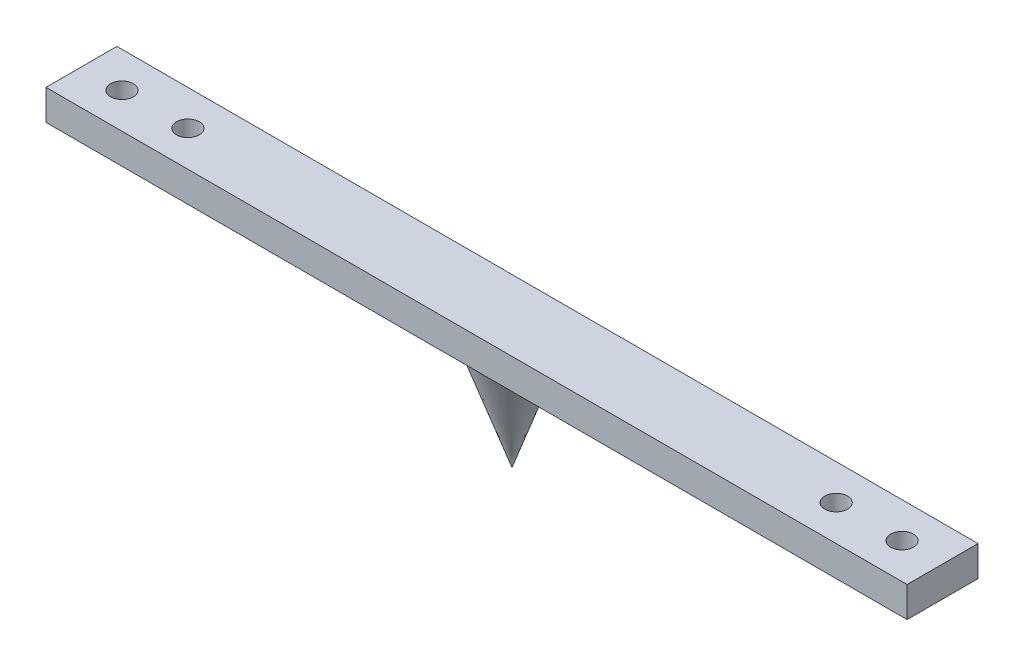
ISO-10303-21;
HEADER;
FILE_DESCRIPTION(('STEP AP214'),'2;1');
FILE_NAME('part.step','',(''),(''),'','','');
FILE_SCHEMA(('AUTOMOTIVE_DESIGN { 1 0 10303 214 1 1 1 1 }'));
ENDSEC;
DATA;
#1=APPLICATION_CONTEXT('core data for automotive mechanical design processes');
#2=APPLICATION_PROTOCOL_DEFINITION('international standard','automotive_design',2000,#1);
#3=PRODUCT_CONTEXT('',#1,'mechanical');
#4=PRODUCT('Part','Part','',(#3));
#5=PRODUCT_RELATED_PRODUCT_CATEGORY('part','',(#4));
#6=PRODUCT_DEFINITION_FORMATION('','',#4);
#7=PRODUCT_DEFINITION_CONTEXT('part definition',#1,'design');
#8=PRODUCT_DEFINITION('design','',#6,#7);
#9=PRODUCT_DEFINITION_SHAPE('','',#8);
#10=(LENGTH_UNIT() NAMED_UNIT(*) SI_UNIT(.MILLI.,.METRE.));
#11=(NAMED_UNIT(*) PLANE_ANGLE_UNIT() SI_UNIT($,.RADIAN.));
#12=(NAMED_UNIT(*) SI_UNIT($,.STERADIAN.) SOLID_ANGLE_UNIT());
#13=UNCERTAINTY_MEASURE_WITH_UNIT(LENGTH_MEASURE(1.E-05),#10,'distance_accuracy_value','');
#14=(GEOMETRIC_REPRESENTATION_CONTEXT(3) GLOBAL_UNCERTAINTY_ASSIGNED_CONTEXT((#13)) GLOBAL_UNIT_ASSIGNED_CONTEXT((#10,
#11,#12)) REPRESENTATION_CONTEXT('',''));
#15=CARTESIAN_POINT('',(0.,0.,0.));
#16=DIRECTION('',(0.,0.,1.));
#17=DIRECTION('',(1.,0.,0.));
#18=AXIS2_PLACEMENT_3D('',#15,#16,#17);
#19=CARTESIAN_POINT('',(0.,0.,0.));
#20=DIRECTION('',(0.,1.,0.));
#21=DIRECTION('',(0.,0.,1.));
#22=AXIS2_PLACEMENT_3D('',#19,#20,#21);
#23=PLANE('',#22);
#24=CARTESIAN_POINT('',(77.,0.,0.));
#25=DIRECTION('',(0.,-1.,0.));
#26=DIRECTION('',(0.,0.,-1.));
#27=AXIS2_PLACEMENT_3D('',#24,#25,#26);
#28=CIRCLE('',#27,3.99999999999999);
#29=CARTESIAN_POINT('',(77.,0.,-3.99999999999999));
#30=VERTEX_POINT('',#29);
#31=EDGE_CURVE('E191',#30,#30,#28,.T.);
#32=ORIENTED_EDGE('',*,*,#31,.F.);
#33=EDGE_LOOP('',(#32));
#34=FACE_BOUND('',#33,.T.);
#35=CARTESIAN_POINT('',(64.,0.,0.));
#36=DIRECTION('',(0.,-1.,0.));
#37=DIRECTION('',(0.,0.,-1.));
#38=AXIS2_PLACEMENT_3D('',#35,#36,#37);
#39=CIRCLE('',#38,3.99999999999999);
#40=CARTESIAN_POINT('',(64.,0.,-3.99999999999999));
#41=VERTEX_POINT('',#40);
#42=EDGE_CURVE('E207',#41,#41,#39,.T.);
#43=ORIENTED_EDGE('',*,*,#42,.F.);
#44=EDGE_LOOP('',(#43));
#45=FACE_BOUND('',#44,.T.);
#46=DIRECTION('',(1.,0.,0.));
#47=VECTOR('',#46,1.);
#48=CARTESIAN_POINT('',(-85.,0.,7.));
#49=LINE('',#48,#47);
#50=CARTESIAN_POINT('',(0.,0.,7.));
#51=VERTEX_POINT('',#50);
#52=CARTESIAN_POINT('',(85.,0.,7.));
#53=VERTEX_POINT('',#52);
#54=EDGE_CURVE('E137',#51,#53,#49,.T.);
#55=ORIENTED_EDGE('',*,*,#54,.F.);
#56=CARTESIAN_POINT('',(0.,0.,0.));
#57=DIRECTION('',(0.,1.,0.));
#58=DIRECTION('',(0.,0.,1.));
#59=AXIS2_PLACEMENT_3D('',#56,#57,#58);
#60=CIRCLE('',#59,7.);
#61=CARTESIAN_POINT('',(0.,0.,-7.));
#62=VERTEX_POINT('',#61);
#63=EDGE_CURVE('E54',#51,#62,#60,.T.);
#64=ORIENTED_EDGE('',*,*,#63,.T.);
#65=DIRECTION('',(-1.,0.,0.));
#66=VECTOR('',#65,1.);
#67=CARTESIAN_POINT('',(-85.,0.,-7.));
#68=LINE('',#67,#66);
#69=CARTESIAN_POINT('',(85.,0.,-7.));
#70=VERTEX_POINT('',#69);
#71=EDGE_CURVE('E153',#70,#62,#68,.T.);
#72=ORIENTED_EDGE('',*,*,#71,.F.);
#73=DIRECTION('',(0.,0.,-1.));
#74=VECTOR('',#73,1.);
#75=CARTESIAN_POINT('',(85.,0.,-7.));
#76=LINE('',#75,#74);
#77=EDGE_CURVE('E144',#53,#70,#76,.T.);
#78=ORIENTED_EDGE('',*,*,#77,.F.);
#79=EDGE_LOOP('',(#55,#64,#72,#78));
#80=FACE_BOUND('',#79,.T.);
#81=ADVANCED_FACE('F39',(#34,#45,#80),#23,.F.);
#82=CARTESIAN_POINT('',(-64.,0.,0.));
#83=DIRECTION('',(0.,-1.,0.));
#84=DIRECTION('',(0.,0.,-1.));
#85=AXIS2_PLACEMENT_3D('',#82,#83,#84);
#86=CIRCLE('',#85,3.99999999999999);
#87=CARTESIAN_POINT('',(-64.,0.,-3.99999999999999));
#88=VERTEX_POINT('',#87);
#89=EDGE_CURVE('E223',#88,#88,#86,.T.);
#90=ORIENTED_EDGE('',*,*,#89,.F.);
#91=EDGE_LOOP('',(#90));
#92=FACE_BOUND('',#91,.T.);
#93=CARTESIAN_POINT('',(-85.,0.,-7.));
#94=VERTEX_POINT('',#93);
#95=EDGE_CURVE('E84',#62,#94,#68,.T.);
#96=ORIENTED_EDGE('',*,*,#95,.F.);
#97=EDGE_CURVE('E244',#62,#51,#60,.T.);
#98=ORIENTED_EDGE('',*,*,#97,.T.);
#99=CARTESIAN_POINT('',(-85.,0.,7.));
#100=VERTEX_POINT('',#99);
#101=EDGE_CURVE('E135',#100,#51,#49,.T.);
#102=ORIENTED_EDGE('',*,*,#101,.F.);
#103=DIRECTION('',(0.,0.,1.));
#104=VECTOR('',#103,1.);
#105=CARTESIAN_POINT('',(-85.,0.,-7.));
#106=LINE('',#105,#104);
#107=EDGE_CURVE('E149',#94,#100,#106,.T.);
#108=ORIENTED_EDGE('',*,*,#107,.F.);
#109=EDGE_LOOP('',(#96,#98,#102,#108));
#110=FACE_BOUND('',#109,.T.);
#111=CARTESIAN_POINT('',(-77.,0.,0.));
#112=DIRECTION('',(0.,-1.,0.));
#113=DIRECTION('',(0.,0.,-1.));
#114=AXIS2_PLACEMENT_3D('',#111,#112,#113);
#115=CIRCLE('',#114,3.99999999999999);
#116=CARTESIAN_POINT('',(-77.,0.,-3.99999999999999));
#117=VERTEX_POINT('',#116);
#118=EDGE_CURVE('E239',#117,#117,#115,.T.);
#119=ORIENTED_EDGE('',*,*,#118,.F.);
#120=EDGE_LOOP('',(#119));
#121=FACE_BOUND('',#120,.T.);
#122=ADVANCED_FACE('F108',(#92,#110,#121),#23,.F.);
#123=CARTESIAN_POINT('',(0.,6.,0.));
#124=DIRECTION('',(0.,1.,0.));
#125=DIRECTION('',(0.,0.,1.));
#126=AXIS2_PLACEMENT_3D('',#123,#124,#125);
#127=PLANE('',#126);
#128=CARTESIAN_POINT('',(-77.,6.,0.));
#129=DIRECTION('',(0.,-1.,0.));
#130=DIRECTION('',(0.,0.,-1.));
#131=AXIS2_PLACEMENT_3D('',#128,#129,#130);
#132=CIRCLE('',#131,2.25);
#133=CARTESIAN_POINT('',(-77.,6.,-2.25));
#134=VERTEX_POINT('',#133);
#135=EDGE_CURVE('E227',#134,#134,#132,.T.);
#136=ORIENTED_EDGE('',*,*,#135,.T.);
#137=EDGE_LOOP('',(#136));
#138=FACE_BOUND('',#137,.T.);
#139=CARTESIAN_POINT('',(-64.,6.,0.));
#140=DIRECTION('',(0.,-1.,0.));
#141=DIRECTION('',(0.,0.,-1.));
#142=AXIS2_PLACEMENT_3D('',#139,#140,#141);
#143=CIRCLE('',#142,2.25);
#144=CARTESIAN_POINT('',(-64.,6.,-2.25));
#145=VERTEX_POINT('',#144);
#146=EDGE_CURVE('E211',#145,#145,#143,.T.);
#147=ORIENTED_EDGE('',*,*,#146,.T.);
#148=EDGE_LOOP('',(#147));
#149=FACE_BOUND('',#148,.T.);
#150=DIRECTION('',(0.,0.,1.));
#151=VECTOR('',#150,1.);
#152=CARTESIAN_POINT('',(-85.,6.,-7.));
#153=LINE('',#152,#151);
#154=CARTESIAN_POINT('',(-85.,6.,-7.));
#155=VERTEX_POINT('',#154);
#156=CARTESIAN_POINT('',(-85.,6.,7.));
#157=VERTEX_POINT('',#156);
#158=EDGE_CURVE('E156',#155,#157,#153,.T.);
#159=ORIENTED_EDGE('',*,*,#158,.T.);
#160=DIRECTION('',(1.,0.,0.));
#161=VECTOR('',#160,1.);
#162=CARTESIAN_POINT('',(-85.,6.,7.));
#163=LINE('',#162,#161);
#164=CARTESIAN_POINT('',(85.,6.,7.));
#165=VERTEX_POINT('',#164);
#166=EDGE_CURVE('E91',#157,#165,#163,.T.);
#167=ORIENTED_EDGE('',*,*,#166,.T.);
#168=DIRECTION('',(0.,0.,-1.));
#169=VECTOR('',#168,1.);
#170=CARTESIAN_POINT('',(85.,6.,-7.));
#171=LINE('',#170,#169);
#172=CARTESIAN_POINT('',(85.,6.,-7.));
#173=VERTEX_POINT('',#172);
#174=EDGE_CURVE('E167',#165,#173,#171,.T.);
#175=ORIENTED_EDGE('',*,*,#174,.T.);
#176=DIRECTION('',(-1.,0.,0.));
#177=VECTOR('',#176,1.);
#178=CARTESIAN_POINT('',(-85.,6.,-7.));
#179=LINE('',#178,#177);
#180=EDGE_CURVE('E63',#173,#155,#179,.T.);
#181=ORIENTED_EDGE('',*,*,#180,.T.);
#182=EDGE_LOOP('',(#159,#167,#175,#181));
#183=FACE_BOUND('',#182,.T.);
#184=CARTESIAN_POINT('',(77.,6.,0.));
#185=DIRECTION('',(0.,-1.,0.));
#186=DIRECTION('',(0.,0.,-1.));
#187=AXIS2_PLACEMENT_3D('',#184,#185,#186);
#188=CIRCLE('',#187,2.25);
#189=CARTESIAN_POINT('',(77.,6.,-2.25));
#190=VERTEX_POINT('',#189);
#191=EDGE_CURVE('E179',#190,#190,#188,.T.);
#192=ORIENTED_EDGE('',*,*,#191,.T.);
#193=EDGE_LOOP('',(#192));
#194=FACE_BOUND('',#193,.T.);
#195=CARTESIAN_POINT('',(64.,6.,0.));
#196=DIRECTION('',(0.,-1.,0.));
#197=DIRECTION('',(0.,0.,-1.));
#198=AXIS2_PLACEMENT_3D('',#195,#196,#197);
#199=CIRCLE('',#198,2.25);
#200=CARTESIAN_POINT('',(64.,6.,-2.25));
#201=VERTEX_POINT('',#200);
#202=EDGE_CURVE('E195',#201,#201,#199,.T.);
#203=ORIENTED_EDGE('',*,*,#202,.T.);
#204=EDGE_LOOP('',(#203));
#205=FACE_BOUND('',#204,.T.);
#206=ADVANCED_FACE('F114',(#138,#149,#183,#194,#205),#127,.T.);
#207=CARTESIAN_POINT('',(-85.,6.,-7.));
#208=DIRECTION('',(1.,0.,0.));
#209=DIRECTION('',(0.,0.,-1.));
#210=AXIS2_PLACEMENT_3D('',#207,#208,#209);
#211=PLANE('',#210);
#212=ORIENTED_EDGE('',*,*,#107,.T.);
#213=DIRECTION('',(0.,-1.,0.));
#214=VECTOR('',#213,1.);
#215=CARTESIAN_POINT('',(-85.,6.,7.));
#216=LINE('',#215,#214);
#217=EDGE_CURVE('E11',#157,#100,#216,.T.);
#218=ORIENTED_EDGE('',*,*,#217,.F.);
#219=ORIENTED_EDGE('',*,*,#158,.F.);
#220=DIRECTION('',(0.,-1.,0.));
#221=VECTOR('',#220,1.);
#222=CARTESIAN_POINT('',(-85.,6.,-7.));
#223=LINE('',#222,#221);
#224=EDGE_CURVE('E157',#155,#94,#223,.T.);
#225=ORIENTED_EDGE('',*,*,#224,.T.);
#226=EDGE_LOOP('',(#212,#218,#219,#225));
#227=FACE_BOUND('',#226,.T.);
#228=ADVANCED_FACE('F41',(#227),#211,.F.);
#229=CARTESIAN_POINT('',(-85.,6.,7.));
#230=DIRECTION('',(0.,0.,-1.));
#231=DIRECTION('',(-1.,0.,0.));
#232=AXIS2_PLACEMENT_3D('',#229,#230,#231);
#233=PLANE('',#232);
#234=ORIENTED_EDGE('',*,*,#101,.T.);
#235=ORIENTED_EDGE('',*,*,#54,.T.);
#236=DIRECTION('',(0.,-1.,0.));
#237=VECTOR('',#236,1.);
#238=CARTESIAN_POINT('',(85.,6.,7.));
#239=LINE('',#238,#237);
#240=EDGE_CURVE('E48',#165,#53,#239,.T.);
#241=ORIENTED_EDGE('',*,*,#240,.F.);
#242=ORIENTED_EDGE('',*,*,#166,.F.);
#243=ORIENTED_EDGE('',*,*,#217,.T.);
#244=EDGE_LOOP('',(#234,#235,#241,#242,#243));
#245=FACE_BOUND('',#244,.T.);
#246=ADVANCED_FACE('F127',(#245),#233,.F.);
#247=CARTESIAN_POINT('',(85.,6.,-7.));
#248=DIRECTION('',(-1.,0.,0.));
#249=DIRECTION('',(0.,0.,1.));
#250=AXIS2_PLACEMENT_3D('',#247,#248,#249);
#251=PLANE('',#250);
#252=ORIENTED_EDGE('',*,*,#77,.T.);
#253=DIRECTION('',(0.,-1.,0.));
#254=VECTOR('',#253,1.);
#255=CARTESIAN_POINT('',(85.,6.,-7.));
#256=LINE('',#255,#254);
#257=EDGE_CURVE('E160',#173,#70,#256,.T.);
#258=ORIENTED_EDGE('',*,*,#257,.F.);
#259=ORIENTED_EDGE('',*,*,#174,.F.);
#260=ORIENTED_EDGE('',*,*,#240,.T.);
#261=EDGE_LOOP('',(#252,#258,#259,#260));
#262=FACE_BOUND('',#261,.T.);
#263=ADVANCED_FACE('F125',(#262),#251,.F.);
#264=CARTESIAN_POINT('',(-85.,6.,-7.));
#265=DIRECTION('',(0.,0.,1.));
#266=DIRECTION('',(1.,0.,0.));
#267=AXIS2_PLACEMENT_3D('',#264,#265,#266);
#268=PLANE('',#267);
#269=ORIENTED_EDGE('',*,*,#71,.T.);
#270=ORIENTED_EDGE('',*,*,#95,.T.);
#271=ORIENTED_EDGE('',*,*,#224,.F.);
#272=ORIENTED_EDGE('',*,*,#180,.F.);
#273=ORIENTED_EDGE('',*,*,#257,.T.);
#274=EDGE_LOOP('',(#269,#270,#271,#272,#273));
#275=FACE_BOUND('',#274,.T.);
#276=ADVANCED_FACE('F121',(#275),#268,.F.);
#277=CARTESIAN_POINT('',(77.,0.,0.));
#278=DIRECTION('',(0.,-1.,0.));
#279=DIRECTION('',(0.,0.,-1.));
#280=AXIS2_PLACEMENT_3D('',#277,#278,#279);
#281=CYLINDRICAL_SURFACE('',#280,2.25000000000001);
#282=ORIENTED_EDGE('',*,*,#191,.F.);
#283=EDGE_LOOP('',(#282));
#284=FACE_BOUND('',#283,.T.);
#285=CARTESIAN_POINT('',(77.,2.2,0.));
#286=DIRECTION('',(0.,-1.,0.));
#287=DIRECTION('',(0.,0.,-1.));
#288=AXIS2_PLACEMENT_3D('',#285,#286,#287);
#289=CIRCLE('',#288,2.25000000000002);
#290=CARTESIAN_POINT('',(77.,2.2,-2.25000000000001));
#291=VERTEX_POINT('',#290);
#292=EDGE_CURVE('E183',#291,#291,#289,.T.);
#293=ORIENTED_EDGE('',*,*,#292,.T.);
#294=EDGE_LOOP('',(#293));
#295=FACE_BOUND('',#294,.T.);
#296=ADVANCED_FACE('F124',(#284,#295),#281,.F.);
#297=CARTESIAN_POINT('',(79.25,2.2,0.));
#298=DIRECTION('',(0.,1.,0.));
#299=DIRECTION('',(0.,0.,1.));
#300=AXIS2_PLACEMENT_3D('',#297,#298,#299);
#301=PLANE('',#300);
#302=ORIENTED_EDGE('',*,*,#292,.F.);
#303=EDGE_LOOP('',(#302));
#304=FACE_BOUND('',#303,.T.);
#305=CARTESIAN_POINT('',(77.,2.2,0.));
#306=DIRECTION('',(0.,-1.,0.));
#307=DIRECTION('',(0.,0.,-1.));
#308=AXIS2_PLACEMENT_3D('',#305,#306,#307);
#309=CIRCLE('',#308,3.99999999999999);
#310=CARTESIAN_POINT('',(77.,2.2,-3.99999999999999));
#311=VERTEX_POINT('',#310);
#312=EDGE_CURVE('E187',#311,#311,#309,.T.);
#313=ORIENTED_EDGE('',*,*,#312,.T.);
#314=EDGE_LOOP('',(#313));
#315=FACE_BOUND('',#314,.T.);
#316=ADVANCED_FACE('F285',(#304,#315),#301,.F.);
#317=CARTESIAN_POINT('',(77.,0.,0.));
#318=DIRECTION('',(0.,-1.,0.));
#319=DIRECTION('',(0.,0.,-1.));
#320=AXIS2_PLACEMENT_3D('',#317,#318,#319);
#321=CYLINDRICAL_SURFACE('',#320,3.99999999999999);
#322=ORIENTED_EDGE('',*,*,#312,.F.);
#323=EDGE_LOOP('',(#322));
#324=FACE_BOUND('',#323,.T.);
#325=ORIENTED_EDGE('',*,*,#31,.T.);
#326=EDGE_LOOP('',(#325));
#327=FACE_BOUND('',#326,.T.);
#328=ADVANCED_FACE('F260',(#324,#327),#321,.F.);
#329=CARTESIAN_POINT('',(64.,0.,0.));
#330=DIRECTION('',(0.,-1.,0.));
#331=DIRECTION('',(0.,0.,-1.));
#332=AXIS2_PLACEMENT_3D('',#329,#330,#331);
#333=CYLINDRICAL_SURFACE('',#332,2.25000000000001);
#334=ORIENTED_EDGE('',*,*,#202,.F.);
#335=EDGE_LOOP('',(#334));
#336=FACE_BOUND('',#335,.T.);
#337=CARTESIAN_POINT('',(64.,2.2,0.));
#338=DIRECTION('',(0.,-1.,0.));
#339=DIRECTION('',(0.,0.,-1.));
#340=AXIS2_PLACEMENT_3D('',#337,#338,#339);
#341=CIRCLE('',#340,2.25000000000002);
#342=CARTESIAN_POINT('',(64.,2.2,-2.25000000000001));
#343=VERTEX_POINT('',#342);
#344=EDGE_CURVE('E199',#343,#343,#341,.T.);
#345=ORIENTED_EDGE('',*,*,#344,.T.);
#346=EDGE_LOOP('',(#345));
#347=FACE_BOUND('',#346,.T.);
#348=ADVANCED_FACE('F256',(#336,#347),#333,.F.);
#349=CARTESIAN_POINT('',(66.25,2.2,0.));
#350=DIRECTION('',(0.,1.,0.));
#351=DIRECTION('',(0.,0.,1.));
#352=AXIS2_PLACEMENT_3D('',#349,#350,#351);
#353=PLANE('',#352);
#354=ORIENTED_EDGE('',*,*,#344,.F.);
#355=EDGE_LOOP('',(#354));
#356=FACE_BOUND('',#355,.T.);
#357=CARTESIAN_POINT('',(64.,2.2,0.));
#358=DIRECTION('',(0.,-1.,0.));
#359=DIRECTION('',(0.,0.,-1.));
#360=AXIS2_PLACEMENT_3D('',#357,#358,#359);
#361=CIRCLE('',#360,3.99999999999999);
#362=CARTESIAN_POINT('',(64.,2.2,-3.99999999999999));
#363=VERTEX_POINT('',#362);
#364=EDGE_CURVE('E203',#363,#363,#361,.T.);
#365=ORIENTED_EDGE('',*,*,#364,.T.);
#366=EDGE_LOOP('',(#365));
#367=FACE_BOUND('',#366,.T.);
#368=ADVANCED_FACE('F259',(#356,#367),#353,.F.);
#369=CARTESIAN_POINT('',(64.,0.,0.));
#370=DIRECTION('',(0.,-1.,0.));
#371=DIRECTION('',(0.,0.,-1.));
#372=AXIS2_PLACEMENT_3D('',#369,#370,#371);
#373=CYLINDRICAL_SURFACE('',#372,3.99999999999999);
#374=ORIENTED_EDGE('',*,*,#364,.F.);
#375=EDGE_LOOP('',(#374));
#376=FACE_BOUND('',#375,.T.);
#377=ORIENTED_EDGE('',*,*,#42,.T.);
#378=EDGE_LOOP('',(#377));
#379=FACE_BOUND('',#378,.T.);
#380=ADVANCED_FACE('F266',(#376,#379),#373,.F.);
#381=CARTESIAN_POINT('',(-64.,0.,0.));
#382=DIRECTION('',(0.,-1.,0.));
#383=DIRECTION('',(0.,0.,-1.));
#384=AXIS2_PLACEMENT_3D('',#381,#382,#383);
#385=CYLINDRICAL_SURFACE('',#384,2.25000000000001);
#386=ORIENTED_EDGE('',*,*,#146,.F.);
#387=EDGE_LOOP('',(#386));
#388=FACE_BOUND('',#387,.T.);
#389=CARTESIAN_POINT('',(-64.,2.2,0.));
#390=DIRECTION('',(0.,-1.,0.));
#391=DIRECTION('',(0.,0.,-1.));
#392=AXIS2_PLACEMENT_3D('',#389,#390,#391);
#393=CIRCLE('',#392,2.25000000000002);
#394=CARTESIAN_POINT('',(-64.,2.2,-2.25000000000002));
#395=VERTEX_POINT('',#394);
#396=EDGE_CURVE('E215',#395,#395,#393,.T.);
#397=ORIENTED_EDGE('',*,*,#396,.T.);
#398=EDGE_LOOP('',(#397));
#399=FACE_BOUND('',#398,.T.);
#400=ADVANCED_FACE('F272',(#388,#399),#385,.F.);
#401=CARTESIAN_POINT('',(-61.75,2.2,0.));
#402=DIRECTION('',(0.,1.,0.));
#403=DIRECTION('',(0.,0.,1.));
#404=AXIS2_PLACEMENT_3D('',#401,#402,#403);
#405=PLANE('',#404);
#406=ORIENTED_EDGE('',*,*,#396,.F.);
#407=EDGE_LOOP('',(#406));
#408=FACE_BOUND('',#407,.T.);
#409=CARTESIAN_POINT('',(-64.,2.2,0.));
#410=DIRECTION('',(0.,-1.,0.));
#411=DIRECTION('',(0.,0.,-1.));
#412=AXIS2_PLACEMENT_3D('',#409,#410,#411);
#413=CIRCLE('',#412,3.99999999999999);
#414=CARTESIAN_POINT('',(-64.,2.2,-3.99999999999999));
#415=VERTEX_POINT('',#414);
#416=EDGE_CURVE('E219',#415,#415,#413,.T.);
#417=ORIENTED_EDGE('',*,*,#416,.T.);
#418=EDGE_LOOP('',(#417));
#419=FACE_BOUND('',#418,.T.);
#420=ADVANCED_FACE('F278',(#408,#419),#405,.F.);
#421=CARTESIAN_POINT('',(-64.,0.,0.));
#422=DIRECTION('',(0.,-1.,0.));
#423=DIRECTION('',(0.,0.,-1.));
#424=AXIS2_PLACEMENT_3D('',#421,#422,#423);
#425=CYLINDRICAL_SURFACE('',#424,3.99999999999999);
#426=ORIENTED_EDGE('',*,*,#416,.F.);
#427=EDGE_LOOP('',(#426));
#428=FACE_BOUND('',#427,.T.);
#429=ORIENTED_EDGE('',*,*,#89,.T.);
#430=EDGE_LOOP('',(#429));
#431=FACE_BOUND('',#430,.T.);
#432=ADVANCED_FACE('F336',(#428,#431),#425,.F.);
#433=CARTESIAN_POINT('',(-77.,0.,0.));
#434=DIRECTION('',(0.,-1.,0.));
#435=DIRECTION('',(0.,0.,-1.));
#436=AXIS2_PLACEMENT_3D('',#433,#434,#435);
#437=CYLINDRICAL_SURFACE('',#436,2.25000000000001);
#438=ORIENTED_EDGE('',*,*,#135,.F.);
#439=EDGE_LOOP('',(#438));
#440=FACE_BOUND('',#439,.T.);
#441=CARTESIAN_POINT('',(-77.,2.2,0.));
#442=DIRECTION('',(0.,-1.,0.));
#443=DIRECTION('',(0.,0.,-1.));
#444=AXIS2_PLACEMENT_3D('',#441,#442,#443);
#445=CIRCLE('',#444,2.25000000000002);
#446=CARTESIAN_POINT('',(-77.,2.2,-2.25000000000002));
#447=VERTEX_POINT('',#446);
#448=EDGE_CURVE('E231',#447,#447,#445,.T.);
#449=ORIENTED_EDGE('',*,*,#448,.T.);
#450=EDGE_LOOP('',(#449));
#451=FACE_BOUND('',#450,.T.);
#452=ADVANCED_FACE('F345',(#440,#451),#437,.F.);
#453=CARTESIAN_POINT('',(-74.75,2.2,0.));
#454=DIRECTION('',(0.,1.,0.));
#455=DIRECTION('',(0.,0.,1.));
#456=AXIS2_PLACEMENT_3D('',#453,#454,#455);
#457=PLANE('',#456);
#458=ORIENTED_EDGE('',*,*,#448,.F.);
#459=EDGE_LOOP('',(#458));
#460=FACE_BOUND('',#459,.T.);
#461=CARTESIAN_POINT('',(-77.,2.2,0.));
#462=DIRECTION('',(0.,-1.,0.));
#463=DIRECTION('',(0.,0.,-1.));
#464=AXIS2_PLACEMENT_3D('',#461,#462,#463);
#465=CIRCLE('',#464,3.99999999999999);
#466=CARTESIAN_POINT('',(-77.,2.2,-3.99999999999999));
#467=VERTEX_POINT('',#466);
#468=EDGE_CURVE('E235',#467,#467,#465,.T.);
#469=ORIENTED_EDGE('',*,*,#468,.T.);
#470=EDGE_LOOP('',(#469));
#471=FACE_BOUND('',#470,.T.);
#472=ADVANCED_FACE('F104',(#460,#471),#457,.F.);
#473=CARTESIAN_POINT('',(-77.,0.,0.));
#474=DIRECTION('',(0.,-1.,0.));
#475=DIRECTION('',(0.,0.,-1.));
#476=AXIS2_PLACEMENT_3D('',#473,#474,#475);
#477=CYLINDRICAL_SURFACE('',#476,3.99999999999999);
#478=ORIENTED_EDGE('',*,*,#468,.F.);
#479=EDGE_LOOP('',(#478));
#480=FACE_BOUND('',#479,.T.);
#481=ORIENTED_EDGE('',*,*,#118,.T.);
#482=EDGE_LOOP('',(#481));
#483=FACE_BOUND('',#482,.T.);
#484=ADVANCED_FACE('F99',(#480,#483),#477,.F.);
#485=CARTESIAN_POINT('',(0.,0.,0.));
#486=DIRECTION('',(0.,1.,0.));
#487=DIRECTION('',(0.,0.,1.));
#488=AXIS2_PLACEMENT_3D('',#485,#486,#487);
#489=CONICAL_SURFACE('',#488,7.,0.336674819386727);
#490=CARTESIAN_POINT('',(0.,-20.,0.));
#491=VERTEX_POINT('',#490);
#492=VERTEX_LOOP('',#491);
#493=FACE_BOUND('',#492,.T.);
#494=ORIENTED_EDGE('',*,*,#63,.F.);
#495=ORIENTED_EDGE('',*,*,#97,.F.);
#496=EDGE_LOOP('',(#494,#495));
#497=FACE_BOUND('',#496,.T.);
#498=ADVANCED_FACE('F97',(#493,#497),#489,.T.);
#499=CLOSED_SHELL('',(#81,#122,#206,#228,#246,#263,#276,#296,#316,#328,#348,#368,#380,#400,#420,
#432,#452,#472,#484,#498));
#500=MANIFOLD_SOLID_BREP('B2',#499);
#501=ADVANCED_BREP_SHAPE_REPRESENTATION('',(#18,#500),#14);
#502=SHAPE_DEFINITION_REPRESENTATION(#9,#501);
ENDSEC;
END-ISO-10303-21;
